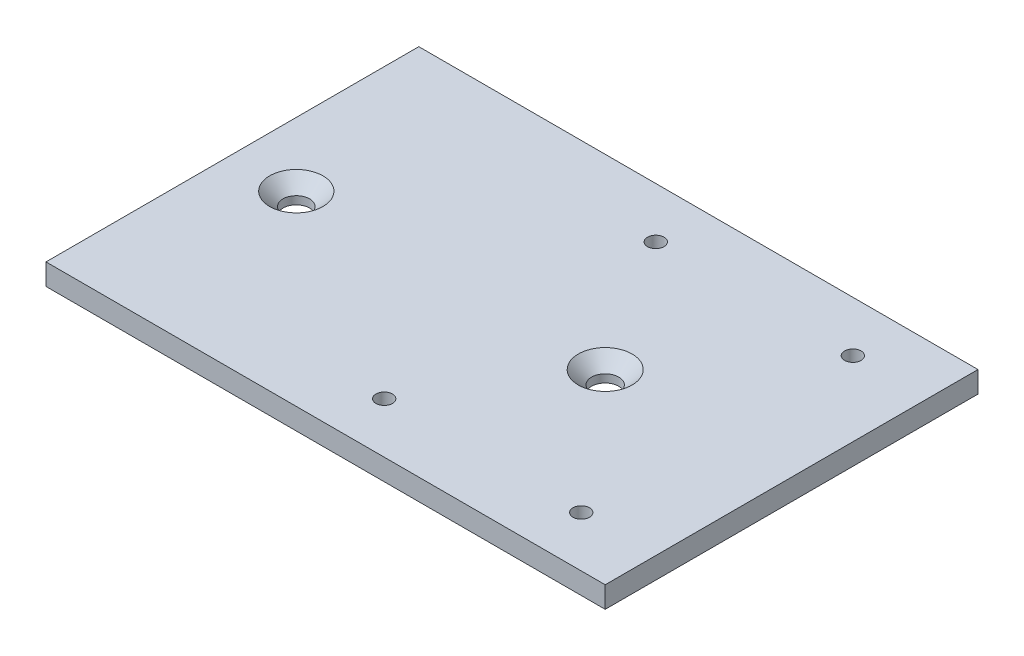
ISO-10303-21;
HEADER;
FILE_DESCRIPTION(('STEP AP214'),'2;1');
FILE_NAME('part.step','',(''),(''),'','','');
FILE_SCHEMA(('AUTOMOTIVE_DESIGN { 1 0 10303 214 1 1 1 1 }'));
ENDSEC;
DATA;
#1=APPLICATION_CONTEXT('core data for automotive mechanical design processes');
#2=APPLICATION_PROTOCOL_DEFINITION('international standard','automotive_design',2000,#1);
#3=PRODUCT_CONTEXT('',#1,'mechanical');
#4=PRODUCT('Part','Part','',(#3));
#5=PRODUCT_RELATED_PRODUCT_CATEGORY('part','',(#4));
#6=PRODUCT_DEFINITION_FORMATION('','',#4);
#7=PRODUCT_DEFINITION_CONTEXT('part definition',#1,'design');
#8=PRODUCT_DEFINITION('design','',#6,#7);
#9=PRODUCT_DEFINITION_SHAPE('','',#8);
#10=(LENGTH_UNIT() NAMED_UNIT(*) SI_UNIT(.MILLI.,.METRE.));
#11=(NAMED_UNIT(*) PLANE_ANGLE_UNIT() SI_UNIT($,.RADIAN.));
#12=(NAMED_UNIT(*) SI_UNIT($,.STERADIAN.) SOLID_ANGLE_UNIT());
#13=UNCERTAINTY_MEASURE_WITH_UNIT(LENGTH_MEASURE(1.E-05),#10,'distance_accuracy_value','');
#14=(GEOMETRIC_REPRESENTATION_CONTEXT(3) GLOBAL_UNCERTAINTY_ASSIGNED_CONTEXT((#13)) GLOBAL_UNIT_ASSIGNED_CONTEXT((#10,
#11,#12)) REPRESENTATION_CONTEXT('',''));
#15=CARTESIAN_POINT('',(0.,0.,0.));
#16=DIRECTION('',(0.,0.,1.));
#17=DIRECTION('',(1.,0.,0.));
#18=AXIS2_PLACEMENT_3D('',#15,#16,#17);
#19=CARTESIAN_POINT('',(0.,4.,0.));
#20=DIRECTION('',(0.,1.,0.));
#21=DIRECTION('',(0.,0.,1.));
#22=AXIS2_PLACEMENT_3D('',#19,#20,#21);
#23=PLANE('',#22);
#24=CARTESIAN_POINT('',(-60.5,4.,0.));
#25=DIRECTION('',(0.,1.,0.));
#26=DIRECTION('',(0.,0.,1.));
#27=AXIS2_PLACEMENT_3D('',#24,#25,#26);
#28=CIRCLE('',#27,5.00000000000003);
#29=CARTESIAN_POINT('',(-60.5,4.,5.00000000000003));
#30=VERTEX_POINT('',#29);
#31=EDGE_CURVE('E11',#30,#30,#28,.F.);
#32=ORIENTED_EDGE('',*,*,#31,.T.);
#33=EDGE_LOOP('',(#32));
#34=FACE_BOUND('',#33,.T.);
#35=CARTESIAN_POINT('',(-2.50000000000001,4.,0.));
#36=DIRECTION('',(0.,1.,0.));
#37=DIRECTION('',(0.,0.,1.));
#38=AXIS2_PLACEMENT_3D('',#35,#36,#37);
#39=CIRCLE('',#38,5.05000000000004);
#40=CARTESIAN_POINT('',(-2.50000000000001,4.,5.05000000000004));
#41=VERTEX_POINT('',#40);
#42=EDGE_CURVE('E177',#41,#41,#39,.F.);
#43=ORIENTED_EDGE('',*,*,#42,.T.);
#44=EDGE_LOOP('',(#43));
#45=FACE_BOUND('',#44,.T.);
#46=CARTESIAN_POINT('',(-18.5,4.,25.5));
#47=DIRECTION('',(0.,1.,0.));
#48=DIRECTION('',(0.,0.,1.));
#49=AXIS2_PLACEMENT_3D('',#46,#47,#48);
#50=CIRCLE('',#49,1.55);
#51=CARTESIAN_POINT('',(-18.5,4.,27.05));
#52=VERTEX_POINT('',#51);
#53=EDGE_CURVE('E142',#52,#52,#50,.T.);
#54=ORIENTED_EDGE('',*,*,#53,.F.);
#55=EDGE_LOOP('',(#54));
#56=FACE_BOUND('',#55,.T.);
#57=CARTESIAN_POINT('',(18.5,4.,-25.5));
#58=DIRECTION('',(0.,1.,0.));
#59=DIRECTION('',(0.,0.,1.));
#60=AXIS2_PLACEMENT_3D('',#57,#58,#59);
#61=CIRCLE('',#60,1.55);
#62=CARTESIAN_POINT('',(18.5,4.,-23.95));
#63=VERTEX_POINT('',#62);
#64=EDGE_CURVE('E94',#63,#63,#61,.T.);
#65=ORIENTED_EDGE('',*,*,#64,.F.);
#66=EDGE_LOOP('',(#65));
#67=FACE_BOUND('',#66,.T.);
#68=DIRECTION('',(1.,0.,0.));
#69=VECTOR('',#68,1.);
#70=CARTESIAN_POINT('',(-22.5,4.,35.));
#71=LINE('',#70,#69);
#72=CARTESIAN_POINT('',(-72.5,4.,35.));
#73=VERTEX_POINT('',#72);
#74=CARTESIAN_POINT('',(32.5,4.,35.));
#75=VERTEX_POINT('',#74);
#76=EDGE_CURVE('E58',#73,#75,#71,.T.);
#77=ORIENTED_EDGE('',*,*,#76,.T.);
#78=DIRECTION('',(0.,0.,1.));
#79=VECTOR('',#78,1.);
#80=CARTESIAN_POINT('',(32.5,4.,35.));
#81=LINE('',#80,#79);
#82=CARTESIAN_POINT('',(32.5,4.,-35.));
#83=VERTEX_POINT('',#82);
#84=EDGE_CURVE('E129',#83,#75,#81,.T.);
#85=ORIENTED_EDGE('',*,*,#84,.F.);
#86=DIRECTION('',(-1.,0.,0.));
#87=VECTOR('',#86,1.);
#88=CARTESIAN_POINT('',(-22.5,4.,-35.));
#89=LINE('',#88,#87);
#90=CARTESIAN_POINT('',(-72.5,4.,-35.));
#91=VERTEX_POINT('',#90);
#92=EDGE_CURVE('E66',#83,#91,#89,.T.);
#93=ORIENTED_EDGE('',*,*,#92,.T.);
#94=DIRECTION('',(0.,0.,-1.));
#95=VECTOR('',#94,1.);
#96=CARTESIAN_POINT('',(-72.5,4.,-35.));
#97=LINE('',#96,#95);
#98=EDGE_CURVE('E108',#73,#91,#97,.T.);
#99=ORIENTED_EDGE('',*,*,#98,.F.);
#100=EDGE_LOOP('',(#77,#85,#93,#99));
#101=FACE_BOUND('',#100,.T.);
#102=CARTESIAN_POINT('',(-18.5,4.,-25.5));
#103=DIRECTION('',(0.,1.,0.));
#104=DIRECTION('',(0.,0.,1.));
#105=AXIS2_PLACEMENT_3D('',#102,#103,#104);
#106=CIRCLE('',#105,1.55);
#107=CARTESIAN_POINT('',(-18.5,4.,-23.95));
#108=VERTEX_POINT('',#107);
#109=EDGE_CURVE('E150',#108,#108,#106,.T.);
#110=ORIENTED_EDGE('',*,*,#109,.F.);
#111=EDGE_LOOP('',(#110));
#112=FACE_BOUND('',#111,.T.);
#113=CARTESIAN_POINT('',(18.5,4.,25.5));
#114=DIRECTION('',(0.,1.,0.));
#115=DIRECTION('',(0.,0.,1.));
#116=AXIS2_PLACEMENT_3D('',#113,#114,#115);
#117=CIRCLE('',#116,1.55);
#118=CARTESIAN_POINT('',(18.5,4.,27.05));
#119=VERTEX_POINT('',#118);
#120=EDGE_CURVE('E133',#119,#119,#117,.T.);
#121=ORIENTED_EDGE('',*,*,#120,.F.);
#122=EDGE_LOOP('',(#121));
#123=FACE_BOUND('',#122,.T.);
#124=ADVANCED_FACE('F41',(#34,#45,#56,#67,#101,#112,#123),#23,.T.);
#125=CARTESIAN_POINT('',(0.,0.,0.));
#126=DIRECTION('',(0.,1.,0.));
#127=DIRECTION('',(0.,0.,1.));
#128=AXIS2_PLACEMENT_3D('',#125,#126,#127);
#129=PLANE('',#128);
#130=CARTESIAN_POINT('',(-60.5,0.,0.));
#131=DIRECTION('',(0.,1.,0.));
#132=DIRECTION('',(0.,0.,1.));
#133=AXIS2_PLACEMENT_3D('',#130,#131,#132);
#134=CIRCLE('',#133,2.5);
#135=CARTESIAN_POINT('',(-60.5,0.,2.5));
#136=VERTEX_POINT('',#135);
#137=EDGE_CURVE('E110',#136,#136,#134,.T.);
#138=ORIENTED_EDGE('',*,*,#137,.T.);
#139=EDGE_LOOP('',(#138));
#140=FACE_BOUND('',#139,.T.);
#141=CARTESIAN_POINT('',(-2.50000000000001,0.,0.));
#142=DIRECTION('',(0.,1.,0.));
#143=DIRECTION('',(0.,0.,1.));
#144=AXIS2_PLACEMENT_3D('',#141,#142,#143);
#145=CIRCLE('',#144,2.55);
#146=CARTESIAN_POINT('',(-2.50000000000001,0.,2.55));
#147=VERTEX_POINT('',#146);
#148=EDGE_CURVE('E132',#147,#147,#145,.T.);
#149=ORIENTED_EDGE('',*,*,#148,.T.);
#150=EDGE_LOOP('',(#149));
#151=FACE_BOUND('',#150,.T.);
#152=DIRECTION('',(-1.,0.,0.));
#153=VECTOR('',#152,1.);
#154=CARTESIAN_POINT('',(-22.5,0.,-35.));
#155=LINE('',#154,#153);
#156=CARTESIAN_POINT('',(32.5,0.,-35.));
#157=VERTEX_POINT('',#156);
#158=CARTESIAN_POINT('',(-72.5,0.,-35.));
#159=VERTEX_POINT('',#158);
#160=EDGE_CURVE('E83',#157,#159,#155,.T.);
#161=ORIENTED_EDGE('',*,*,#160,.F.);
#162=DIRECTION('',(0.,0.,-1.));
#163=VECTOR('',#162,1.);
#164=CARTESIAN_POINT('',(32.5,0.,35.));
#165=LINE('',#164,#163);
#166=CARTESIAN_POINT('',(32.5,0.,35.));
#167=VERTEX_POINT('',#166);
#168=EDGE_CURVE('E124',#167,#157,#165,.T.);
#169=ORIENTED_EDGE('',*,*,#168,.F.);
#170=DIRECTION('',(1.,0.,0.));
#171=VECTOR('',#170,1.);
#172=CARTESIAN_POINT('',(-22.5,0.,35.));
#173=LINE('',#172,#171);
#174=CARTESIAN_POINT('',(-72.5,0.,35.));
#175=VERTEX_POINT('',#174);
#176=EDGE_CURVE('E93',#175,#167,#173,.T.);
#177=ORIENTED_EDGE('',*,*,#176,.F.);
#178=DIRECTION('',(0.,0.,1.));
#179=VECTOR('',#178,1.);
#180=CARTESIAN_POINT('',(-72.5,0.,-35.));
#181=LINE('',#180,#179);
#182=EDGE_CURVE('E97',#159,#175,#181,.T.);
#183=ORIENTED_EDGE('',*,*,#182,.F.);
#184=EDGE_LOOP('',(#161,#169,#177,#183));
#185=FACE_BOUND('',#184,.T.);
#186=CARTESIAN_POINT('',(18.5,0.,-25.5));
#187=DIRECTION('',(0.,1.,0.));
#188=DIRECTION('',(0.,0.,1.));
#189=AXIS2_PLACEMENT_3D('',#186,#187,#188);
#190=CIRCLE('',#189,1.55);
#191=CARTESIAN_POINT('',(18.5,0.,-23.95));
#192=VERTEX_POINT('',#191);
#193=EDGE_CURVE('E154',#192,#192,#190,.T.);
#194=ORIENTED_EDGE('',*,*,#193,.T.);
#195=EDGE_LOOP('',(#194));
#196=FACE_BOUND('',#195,.T.);
#197=CARTESIAN_POINT('',(-18.5,0.,-25.5));
#198=DIRECTION('',(0.,1.,0.));
#199=DIRECTION('',(0.,0.,1.));
#200=AXIS2_PLACEMENT_3D('',#197,#198,#199);
#201=CIRCLE('',#200,1.55);
#202=CARTESIAN_POINT('',(-18.5,0.,-23.95));
#203=VERTEX_POINT('',#202);
#204=EDGE_CURVE('E146',#203,#203,#201,.T.);
#205=ORIENTED_EDGE('',*,*,#204,.T.);
#206=EDGE_LOOP('',(#205));
#207=FACE_BOUND('',#206,.T.);
#208=CARTESIAN_POINT('',(-18.5,0.,25.5));
#209=DIRECTION('',(0.,1.,0.));
#210=DIRECTION('',(0.,0.,1.));
#211=AXIS2_PLACEMENT_3D('',#208,#209,#210);
#212=CIRCLE('',#211,1.55);
#213=CARTESIAN_POINT('',(-18.5,0.,27.05));
#214=VERTEX_POINT('',#213);
#215=EDGE_CURVE('E137',#214,#214,#212,.T.);
#216=ORIENTED_EDGE('',*,*,#215,.T.);
#217=EDGE_LOOP('',(#216));
#218=FACE_BOUND('',#217,.T.);
#219=CARTESIAN_POINT('',(18.5,0.,25.5));
#220=DIRECTION('',(0.,1.,0.));
#221=DIRECTION('',(0.,0.,1.));
#222=AXIS2_PLACEMENT_3D('',#219,#220,#221);
#223=CIRCLE('',#222,1.55);
#224=CARTESIAN_POINT('',(18.5,0.,27.05));
#225=VERTEX_POINT('',#224);
#226=EDGE_CURVE('E138',#225,#225,#223,.T.);
#227=ORIENTED_EDGE('',*,*,#226,.T.);
#228=EDGE_LOOP('',(#227));
#229=FACE_BOUND('',#228,.T.);
#230=ADVANCED_FACE('F98',(#140,#151,#185,#196,#207,#218,#229),#129,.F.);
#231=CARTESIAN_POINT('',(-22.5,4.,-35.));
#232=DIRECTION('',(0.,0.,1.));
#233=DIRECTION('',(1.,0.,0.));
#234=AXIS2_PLACEMENT_3D('',#231,#232,#233);
#235=PLANE('',#234);
#236=ORIENTED_EDGE('',*,*,#160,.T.);
#237=DIRECTION('',(0.,-1.,0.));
#238=VECTOR('',#237,1.);
#239=CARTESIAN_POINT('',(-72.5,0.,-35.));
#240=LINE('',#239,#238);
#241=EDGE_CURVE('E87',#91,#159,#240,.T.);
#242=ORIENTED_EDGE('',*,*,#241,.F.);
#243=ORIENTED_EDGE('',*,*,#92,.F.);
#244=DIRECTION('',(0.,1.,0.));
#245=VECTOR('',#244,1.);
#246=CARTESIAN_POINT('',(32.5,0.,-35.));
#247=LINE('',#246,#245);
#248=EDGE_CURVE('E88',#157,#83,#247,.T.);
#249=ORIENTED_EDGE('',*,*,#248,.F.);
#250=EDGE_LOOP('',(#236,#242,#243,#249));
#251=FACE_BOUND('',#250,.T.);
#252=ADVANCED_FACE('F85',(#251),#235,.F.);
#253=CARTESIAN_POINT('',(-22.5,4.,35.));
#254=DIRECTION('',(0.,0.,-1.));
#255=DIRECTION('',(-1.,0.,0.));
#256=AXIS2_PLACEMENT_3D('',#253,#254,#255);
#257=PLANE('',#256);
#258=ORIENTED_EDGE('',*,*,#176,.T.);
#259=DIRECTION('',(0.,-1.,0.));
#260=VECTOR('',#259,1.);
#261=CARTESIAN_POINT('',(32.5,0.,35.));
#262=LINE('',#261,#260);
#263=EDGE_CURVE('E120',#75,#167,#262,.T.);
#264=ORIENTED_EDGE('',*,*,#263,.F.);
#265=ORIENTED_EDGE('',*,*,#76,.F.);
#266=DIRECTION('',(0.,1.,0.));
#267=VECTOR('',#266,1.);
#268=CARTESIAN_POINT('',(-72.5,0.,35.));
#269=LINE('',#268,#267);
#270=EDGE_CURVE('E104',#175,#73,#269,.T.);
#271=ORIENTED_EDGE('',*,*,#270,.F.);
#272=EDGE_LOOP('',(#258,#264,#265,#271));
#273=FACE_BOUND('',#272,.T.);
#274=ADVANCED_FACE('F207',(#273),#257,.F.);
#275=CARTESIAN_POINT('',(18.5,4.,-25.5));
#276=DIRECTION('',(0.,-1.,0.));
#277=DIRECTION('',(0.,0.,-1.));
#278=AXIS2_PLACEMENT_3D('',#275,#276,#277);
#279=CYLINDRICAL_SURFACE('',#278,1.55);
#280=ORIENTED_EDGE('',*,*,#64,.T.);
#281=EDGE_LOOP('',(#280));
#282=FACE_BOUND('',#281,.T.);
#283=ORIENTED_EDGE('',*,*,#193,.F.);
#284=EDGE_LOOP('',(#283));
#285=FACE_BOUND('',#284,.T.);
#286=ADVANCED_FACE('F204',(#282,#285),#279,.F.);
#287=CARTESIAN_POINT('',(-18.5,4.,-25.5));
#288=DIRECTION('',(0.,-1.,0.));
#289=DIRECTION('',(0.,0.,-1.));
#290=AXIS2_PLACEMENT_3D('',#287,#288,#289);
#291=CYLINDRICAL_SURFACE('',#290,1.55);
#292=ORIENTED_EDGE('',*,*,#109,.T.);
#293=EDGE_LOOP('',(#292));
#294=FACE_BOUND('',#293,.T.);
#295=ORIENTED_EDGE('',*,*,#204,.F.);
#296=EDGE_LOOP('',(#295));
#297=FACE_BOUND('',#296,.T.);
#298=ADVANCED_FACE('F253',(#294,#297),#291,.F.);
#299=CARTESIAN_POINT('',(-18.5,4.,25.5));
#300=DIRECTION('',(0.,-1.,0.));
#301=DIRECTION('',(0.,0.,-1.));
#302=AXIS2_PLACEMENT_3D('',#299,#300,#301);
#303=CYLINDRICAL_SURFACE('',#302,1.55);
#304=ORIENTED_EDGE('',*,*,#53,.T.);
#305=EDGE_LOOP('',(#304));
#306=FACE_BOUND('',#305,.T.);
#307=ORIENTED_EDGE('',*,*,#215,.F.);
#308=EDGE_LOOP('',(#307));
#309=FACE_BOUND('',#308,.T.);
#310=ADVANCED_FACE('F246',(#306,#309),#303,.F.);
#311=CARTESIAN_POINT('',(18.5,4.,25.5));
#312=DIRECTION('',(0.,-1.,0.));
#313=DIRECTION('',(0.,0.,-1.));
#314=AXIS2_PLACEMENT_3D('',#311,#312,#313);
#315=CYLINDRICAL_SURFACE('',#314,1.55);
#316=ORIENTED_EDGE('',*,*,#120,.T.);
#317=EDGE_LOOP('',(#316));
#318=FACE_BOUND('',#317,.T.);
#319=ORIENTED_EDGE('',*,*,#226,.F.);
#320=EDGE_LOOP('',(#319));
#321=FACE_BOUND('',#320,.T.);
#322=ADVANCED_FACE('F226',(#318,#321),#315,.F.);
#323=CARTESIAN_POINT('',(-2.50000000000001,-2.,0.));
#324=DIRECTION('',(0.,1.,0.));
#325=DIRECTION('',(0.,0.,1.));
#326=AXIS2_PLACEMENT_3D('',#323,#324,#325);
#327=CYLINDRICAL_SURFACE('',#326,2.55);
#328=CARTESIAN_POINT('',(-2.50000000000001,1.49999999999998,0.));
#329=DIRECTION('',(0.,1.,0.));
#330=DIRECTION('',(0.,0.,1.));
#331=AXIS2_PLACEMENT_3D('',#328,#329,#330);
#332=CIRCLE('',#331,2.55);
#333=CARTESIAN_POINT('',(-2.50000000000001,1.49999999999998,2.55));
#334=VERTEX_POINT('',#333);
#335=EDGE_CURVE('E167',#334,#334,#332,.T.);
#336=ORIENTED_EDGE('',*,*,#335,.T.);
#337=EDGE_LOOP('',(#336));
#338=FACE_BOUND('',#337,.T.);
#339=ORIENTED_EDGE('',*,*,#148,.F.);
#340=EDGE_LOOP('',(#339));
#341=FACE_BOUND('',#340,.T.);
#342=ADVANCED_FACE('F218',(#338,#341),#327,.F.);
#343=CARTESIAN_POINT('',(-2.50000000000001,1.49999999999998,0.));
#344=DIRECTION('',(0.,1.,0.));
#345=DIRECTION('',(0.,0.,1.));
#346=AXIS2_PLACEMENT_3D('',#343,#344,#345);
#347=CONICAL_SURFACE('',#346,2.55,0.785398163397452);
#348=ORIENTED_EDGE('',*,*,#42,.F.);
#349=EDGE_LOOP('',(#348));
#350=FACE_BOUND('',#349,.T.);
#351=ORIENTED_EDGE('',*,*,#335,.F.);
#352=EDGE_LOOP('',(#351));
#353=FACE_BOUND('',#352,.T.);
#354=ADVANCED_FACE('F213',(#350,#353),#347,.F.);
#355=CARTESIAN_POINT('',(32.5,0.,0.));
#356=DIRECTION('',(-1.,0.,0.));
#357=DIRECTION('',(0.,0.,1.));
#358=AXIS2_PLACEMENT_3D('',#355,#356,#357);
#359=PLANE('',#358);
#360=ORIENTED_EDGE('',*,*,#263,.T.);
#361=ORIENTED_EDGE('',*,*,#168,.T.);
#362=ORIENTED_EDGE('',*,*,#248,.T.);
#363=ORIENTED_EDGE('',*,*,#84,.T.);
#364=EDGE_LOOP('',(#360,#361,#362,#363));
#365=FACE_BOUND('',#364,.T.);
#366=ADVANCED_FACE('F217',(#365),#359,.F.);
#367=CARTESIAN_POINT('',(-72.5,0.,0.));
#368=DIRECTION('',(1.,0.,0.));
#369=DIRECTION('',(0.,0.,-1.));
#370=AXIS2_PLACEMENT_3D('',#367,#368,#369);
#371=PLANE('',#370);
#372=ORIENTED_EDGE('',*,*,#241,.T.);
#373=ORIENTED_EDGE('',*,*,#182,.T.);
#374=ORIENTED_EDGE('',*,*,#270,.T.);
#375=ORIENTED_EDGE('',*,*,#98,.T.);
#376=EDGE_LOOP('',(#372,#373,#374,#375));
#377=FACE_BOUND('',#376,.T.);
#378=ADVANCED_FACE('F107',(#377),#371,.F.);
#379=CARTESIAN_POINT('',(-60.5,-6.,0.));
#380=DIRECTION('',(0.,1.,0.));
#381=DIRECTION('',(0.,0.,1.));
#382=AXIS2_PLACEMENT_3D('',#379,#380,#381);
#383=CYLINDRICAL_SURFACE('',#382,2.5);
#384=CARTESIAN_POINT('',(-60.5,1.49999999999999,0.));
#385=DIRECTION('',(0.,1.,0.));
#386=DIRECTION('',(0.,0.,1.));
#387=AXIS2_PLACEMENT_3D('',#384,#385,#386);
#388=CIRCLE('',#387,2.5);
#389=CARTESIAN_POINT('',(-60.5,1.49999999999999,2.5));
#390=VERTEX_POINT('',#389);
#391=EDGE_CURVE('E51',#390,#390,#388,.T.);
#392=ORIENTED_EDGE('',*,*,#391,.T.);
#393=EDGE_LOOP('',(#392));
#394=FACE_BOUND('',#393,.T.);
#395=ORIENTED_EDGE('',*,*,#137,.F.);
#396=EDGE_LOOP('',(#395));
#397=FACE_BOUND('',#396,.T.);
#398=ADVANCED_FACE('F184',(#394,#397),#383,.F.);
#399=CARTESIAN_POINT('',(-60.5,1.49999999999999,0.));
#400=DIRECTION('',(0.,1.,0.));
#401=DIRECTION('',(0.,0.,1.));
#402=AXIS2_PLACEMENT_3D('',#399,#400,#401);
#403=CONICAL_SURFACE('',#402,2.5,0.785398163397452);
#404=ORIENTED_EDGE('',*,*,#31,.F.);
#405=EDGE_LOOP('',(#404));
#406=FACE_BOUND('',#405,.T.);
#407=ORIENTED_EDGE('',*,*,#391,.F.);
#408=EDGE_LOOP('',(#407));
#409=FACE_BOUND('',#408,.T.);
#410=ADVANCED_FACE('F44',(#406,#409),#403,.F.);
#411=CLOSED_SHELL('',(#124,#230,#252,#274,#286,#298,#310,#322,#342,#354,#366,#378,#398,#410));
#412=MANIFOLD_SOLID_BREP('B2',#411);
#413=ADVANCED_BREP_SHAPE_REPRESENTATION('',(#18,#412),#14);
#414=SHAPE_DEFINITION_REPRESENTATION(#9,#413);
ENDSEC;
END-ISO-10303-21;
